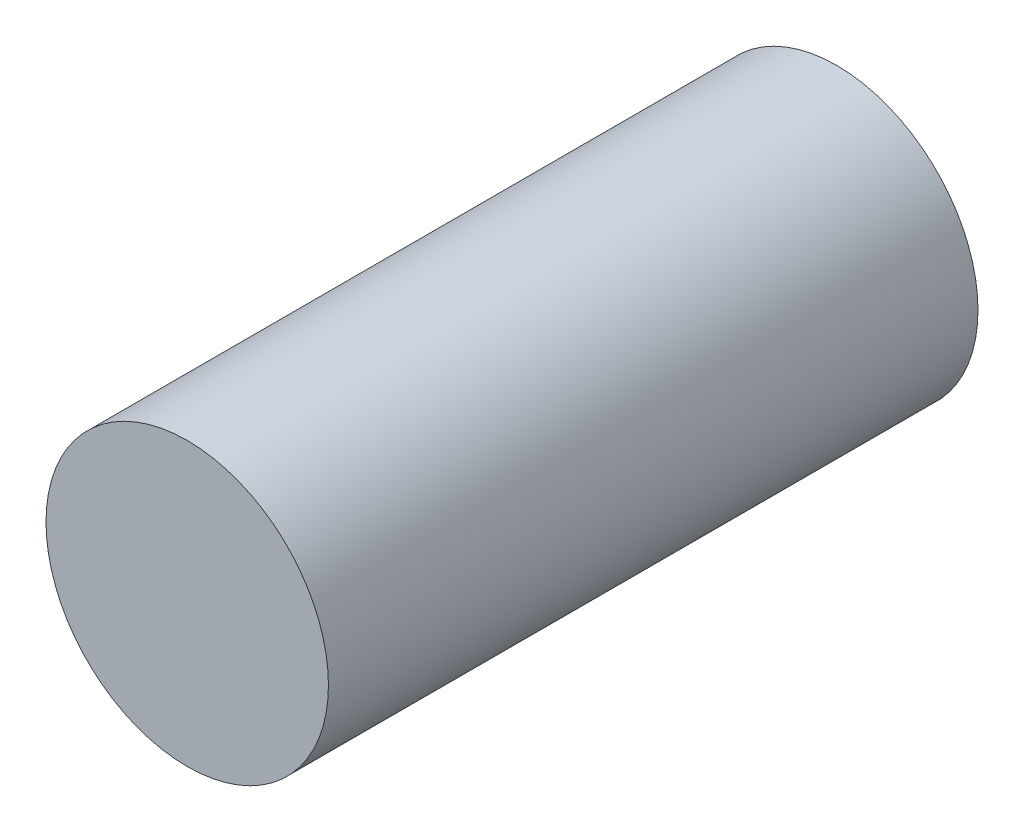
ISO-10303-21;
HEADER;
FILE_DESCRIPTION(('STEP AP214'),'2;1');
FILE_NAME('part.step','',(''),(''),'','','');
FILE_SCHEMA(('AUTOMOTIVE_DESIGN { 1 0 10303 214 1 1 1 1 }'));
ENDSEC;
DATA;
#1=APPLICATION_CONTEXT('core data for automotive mechanical design processes');
#2=APPLICATION_PROTOCOL_DEFINITION('international standard','automotive_design',2000,#1);
#3=PRODUCT_CONTEXT('',#1,'mechanical');
#4=PRODUCT('Part','Part','',(#3));
#5=PRODUCT_RELATED_PRODUCT_CATEGORY('part','',(#4));
#6=PRODUCT_DEFINITION_FORMATION('','',#4);
#7=PRODUCT_DEFINITION_CONTEXT('part definition',#1,'design');
#8=PRODUCT_DEFINITION('design','',#6,#7);
#9=PRODUCT_DEFINITION_SHAPE('','',#8);
#10=(LENGTH_UNIT() NAMED_UNIT(*) SI_UNIT(.MILLI.,.METRE.));
#11=(NAMED_UNIT(*) PLANE_ANGLE_UNIT() SI_UNIT($,.RADIAN.));
#12=(NAMED_UNIT(*) SI_UNIT($,.STERADIAN.) SOLID_ANGLE_UNIT());
#13=UNCERTAINTY_MEASURE_WITH_UNIT(LENGTH_MEASURE(1.E-05),#10,'distance_accuracy_value','');
#14=(GEOMETRIC_REPRESENTATION_CONTEXT(3) GLOBAL_UNCERTAINTY_ASSIGNED_CONTEXT((#13)) GLOBAL_UNIT_ASSIGNED_CONTEXT((#10,
#11,#12)) REPRESENTATION_CONTEXT('',''));
#15=CARTESIAN_POINT('',(0.,0.,0.));
#16=DIRECTION('',(0.,0.,1.));
#17=DIRECTION('',(1.,0.,0.));
#18=AXIS2_PLACEMENT_3D('',#15,#16,#17);
#19=CARTESIAN_POINT('',(0.,0.,5.842));
#20=DIRECTION('',(0.,0.,-1.));
#21=DIRECTION('',(-1.,0.,0.));
#22=AXIS2_PLACEMENT_3D('',#19,#20,#21);
#23=CYLINDRICAL_SURFACE('',#22,1.27);
#24=CARTESIAN_POINT('',(0.,0.,5.842));
#25=DIRECTION('',(0.,0.,1.));
#26=DIRECTION('',(1.,0.,0.));
#27=AXIS2_PLACEMENT_3D('',#24,#25,#26);
#28=CIRCLE('',#27,1.27);
#29=CARTESIAN_POINT('',(1.27,0.,5.842));
#30=VERTEX_POINT('',#29);
#31=EDGE_CURVE('E10',#30,#30,#28,.T.);
#32=ORIENTED_EDGE('',*,*,#31,.F.);
#33=EDGE_LOOP('',(#32));
#34=FACE_BOUND('',#33,.T.);
#35=CARTESIAN_POINT('',(0.,0.,0.));
#36=DIRECTION('',(0.,0.,1.));
#37=DIRECTION('',(1.,0.,0.));
#38=AXIS2_PLACEMENT_3D('',#35,#36,#37);
#39=CIRCLE('',#38,1.27);
#40=CARTESIAN_POINT('',(1.27,0.,0.));
#41=VERTEX_POINT('',#40);
#42=EDGE_CURVE('E38',#41,#41,#39,.T.);
#43=ORIENTED_EDGE('',*,*,#42,.T.);
#44=EDGE_LOOP('',(#43));
#45=FACE_BOUND('',#44,.T.);
#46=ADVANCED_FACE('F35',(#34,#45),#23,.T.);
#47=CARTESIAN_POINT('',(0.,0.,5.842));
#48=DIRECTION('',(0.,0.,1.));
#49=DIRECTION('',(1.,0.,0.));
#50=AXIS2_PLACEMENT_3D('',#47,#48,#49);
#51=PLANE('',#50);
#52=ORIENTED_EDGE('',*,*,#31,.T.);
#53=EDGE_LOOP('',(#52));
#54=FACE_BOUND('',#53,.T.);
#55=ADVANCED_FACE('F50',(#54),#51,.T.);
#56=CARTESIAN_POINT('',(0.,0.,0.));
#57=DIRECTION('',(0.,0.,1.));
#58=DIRECTION('',(1.,0.,0.));
#59=AXIS2_PLACEMENT_3D('',#56,#57,#58);
#60=PLANE('',#59);
#61=ORIENTED_EDGE('',*,*,#42,.F.);
#62=EDGE_LOOP('',(#61));
#63=FACE_BOUND('',#62,.T.);
#64=ADVANCED_FACE('F48',(#63),#60,.F.);
#65=CLOSED_SHELL('',(#46,#55,#64));
#66=MANIFOLD_SOLID_BREP('B2',#65);
#67=ADVANCED_BREP_SHAPE_REPRESENTATION('',(#18,#66),#14);
#68=SHAPE_DEFINITION_REPRESENTATION(#9,#67);
ENDSEC;
END-ISO-10303-21;
